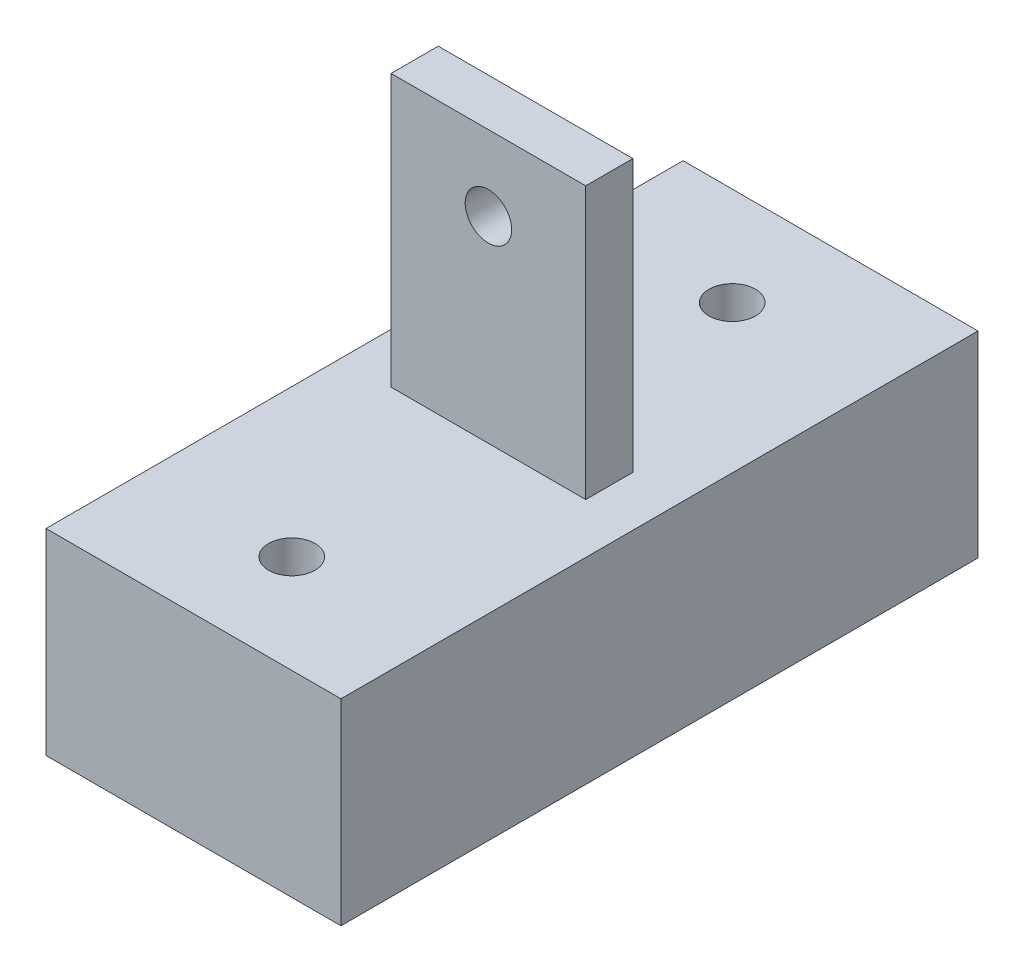
ISO-10303-21;
HEADER;
FILE_DESCRIPTION(('STEP AP214'),'2;1');
FILE_NAME('part.step','',(''),(''),'','','');
FILE_SCHEMA(('AUTOMOTIVE_DESIGN { 1 0 10303 214 1 1 1 1 }'));
ENDSEC;
DATA;
#1=APPLICATION_CONTEXT('core data for automotive mechanical design processes');
#2=APPLICATION_PROTOCOL_DEFINITION('international standard','automotive_design',2000,#1);
#3=PRODUCT_CONTEXT('',#1,'mechanical');
#4=PRODUCT('Part','Part','',(#3));
#5=PRODUCT_RELATED_PRODUCT_CATEGORY('part','',(#4));
#6=PRODUCT_DEFINITION_FORMATION('','',#4);
#7=PRODUCT_DEFINITION_CONTEXT('part definition',#1,'design');
#8=PRODUCT_DEFINITION('design','',#6,#7);
#9=PRODUCT_DEFINITION_SHAPE('','',#8);
#10=(LENGTH_UNIT() NAMED_UNIT(*) SI_UNIT(.MILLI.,.METRE.));
#11=(NAMED_UNIT(*) PLANE_ANGLE_UNIT() SI_UNIT($,.RADIAN.));
#12=(NAMED_UNIT(*) SI_UNIT($,.STERADIAN.) SOLID_ANGLE_UNIT());
#13=UNCERTAINTY_MEASURE_WITH_UNIT(LENGTH_MEASURE(1.E-05),#10,'distance_accuracy_value','');
#14=(GEOMETRIC_REPRESENTATION_CONTEXT(3) GLOBAL_UNCERTAINTY_ASSIGNED_CONTEXT((#13)) GLOBAL_UNIT_ASSIGNED_CONTEXT((#10,
#11,#12)) REPRESENTATION_CONTEXT('',''));
#15=CARTESIAN_POINT('',(0.,0.,0.));
#16=DIRECTION('',(0.,0.,1.));
#17=DIRECTION('',(1.,0.,0.));
#18=AXIS2_PLACEMENT_3D('',#15,#16,#17);
#19=CARTESIAN_POINT('',(0.,0.,-14.224));
#20=DIRECTION('',(0.,1.,0.));
#21=DIRECTION('',(0.,0.,1.));
#22=AXIS2_PLACEMENT_3D('',#19,#20,#21);
#23=CYLINDRICAL_SURFACE('',#22,1.5);
#24=CARTESIAN_POINT('',(0.,12.7,-14.224));
#25=DIRECTION('',(0.,1.,0.));
#26=DIRECTION('',(0.,0.,1.));
#27=AXIS2_PLACEMENT_3D('',#24,#25,#26);
#28=CIRCLE('',#27,1.5);
#29=CARTESIAN_POINT('',(0.,12.7,-12.724));
#30=VERTEX_POINT('',#29);
#31=EDGE_CURVE('E193',#30,#30,#28,.T.);
#32=ORIENTED_EDGE('',*,*,#31,.T.);
#33=EDGE_LOOP('',(#32));
#34=FACE_BOUND('',#33,.T.);
#35=CARTESIAN_POINT('',(0.,6.35,-14.224));
#36=DIRECTION('',(0.,-1.,0.));
#37=DIRECTION('',(0.,0.,-1.));
#38=AXIS2_PLACEMENT_3D('',#35,#36,#37);
#39=CIRCLE('',#38,1.5);
#40=CARTESIAN_POINT('',(0.,6.35,-15.724));
#41=VERTEX_POINT('',#40);
#42=EDGE_CURVE('E44',#41,#41,#39,.F.);
#43=ORIENTED_EDGE('',*,*,#42,.F.);
#44=EDGE_LOOP('',(#43));
#45=FACE_BOUND('',#44,.T.);
#46=ADVANCED_FACE('F40',(#34,#45),#23,.F.);
#47=CARTESIAN_POINT('',(0.,0.,14.224));
#48=DIRECTION('',(0.,1.,0.));
#49=DIRECTION('',(0.,0.,1.));
#50=AXIS2_PLACEMENT_3D('',#47,#48,#49);
#51=CYLINDRICAL_SURFACE('',#50,1.5);
#52=CARTESIAN_POINT('',(0.,12.7,14.224));
#53=DIRECTION('',(0.,1.,0.));
#54=DIRECTION('',(0.,0.,1.));
#55=AXIS2_PLACEMENT_3D('',#52,#53,#54);
#56=CIRCLE('',#55,1.5);
#57=CARTESIAN_POINT('',(0.,12.7,15.724));
#58=VERTEX_POINT('',#57);
#59=EDGE_CURVE('E125',#58,#58,#56,.T.);
#60=ORIENTED_EDGE('',*,*,#59,.T.);
#61=EDGE_LOOP('',(#60));
#62=FACE_BOUND('',#61,.T.);
#63=CARTESIAN_POINT('',(0.,6.35,14.224));
#64=DIRECTION('',(0.,-1.,0.));
#65=DIRECTION('',(0.,0.,-1.));
#66=AXIS2_PLACEMENT_3D('',#63,#64,#65);
#67=CIRCLE('',#66,1.5);
#68=CARTESIAN_POINT('',(0.,6.35,12.724));
#69=VERTEX_POINT('',#68);
#70=EDGE_CURVE('E184',#69,#69,#67,.F.);
#71=ORIENTED_EDGE('',*,*,#70,.F.);
#72=EDGE_LOOP('',(#71));
#73=FACE_BOUND('',#72,.T.);
#74=ADVANCED_FACE('F255',(#62,#73),#51,.F.);
#75=CARTESIAN_POINT('',(9.525,0.,-20.574));
#76=DIRECTION('',(0.,0.,-1.));
#77=DIRECTION('',(0.,1.,0.));
#78=AXIS2_PLACEMENT_3D('',#75,#76,#77);
#79=PLANE('',#78);
#80=DIRECTION('',(0.,-1.,0.));
#81=VECTOR('',#80,1.);
#82=CARTESIAN_POINT('',(-9.525,0.,-20.574));
#83=LINE('',#82,#81);
#84=CARTESIAN_POINT('',(-9.525,12.7,-20.574));
#85=VERTEX_POINT('',#84);
#86=CARTESIAN_POINT('',(-9.525,0.,-20.574));
#87=VERTEX_POINT('',#86);
#88=EDGE_CURVE('E147',#85,#87,#83,.T.);
#89=ORIENTED_EDGE('',*,*,#88,.F.);
#90=DIRECTION('',(-1.,0.,0.));
#91=VECTOR('',#90,1.);
#92=CARTESIAN_POINT('',(9.525,12.7,-20.574));
#93=LINE('',#92,#91);
#94=CARTESIAN_POINT('',(9.525,12.7,-20.574));
#95=VERTEX_POINT('',#94);
#96=EDGE_CURVE('E11',#95,#85,#93,.T.);
#97=ORIENTED_EDGE('',*,*,#96,.F.);
#98=DIRECTION('',(0.,-1.,0.));
#99=VECTOR('',#98,1.);
#100=CARTESIAN_POINT('',(9.525,0.,-20.574));
#101=LINE('',#100,#99);
#102=CARTESIAN_POINT('',(9.525,0.,-20.574));
#103=VERTEX_POINT('',#102);
#104=EDGE_CURVE('E148',#95,#103,#101,.T.);
#105=ORIENTED_EDGE('',*,*,#104,.T.);
#106=DIRECTION('',(-1.,0.,0.));
#107=VECTOR('',#106,1.);
#108=CARTESIAN_POINT('',(9.525,0.,-20.574));
#109=LINE('',#108,#107);
#110=EDGE_CURVE('E163',#103,#87,#109,.T.);
#111=ORIENTED_EDGE('',*,*,#110,.T.);
#112=EDGE_LOOP('',(#89,#97,#105,#111));
#113=FACE_BOUND('',#112,.T.);
#114=ADVANCED_FACE('F42',(#113),#79,.T.);
#115=CARTESIAN_POINT('',(9.525,12.7,0.));
#116=DIRECTION('',(0.,1.,0.));
#117=DIRECTION('',(0.,0.,1.));
#118=AXIS2_PLACEMENT_3D('',#115,#116,#117);
#119=PLANE('',#118);
#120=ORIENTED_EDGE('',*,*,#59,.F.);
#121=EDGE_LOOP('',(#120));
#122=FACE_BOUND('',#121,.T.);
#123=ORIENTED_EDGE('',*,*,#31,.F.);
#124=EDGE_LOOP('',(#123));
#125=FACE_BOUND('',#124,.T.);
#126=DIRECTION('',(0.,0.,-1.));
#127=VECTOR('',#126,1.);
#128=CARTESIAN_POINT('',(6.2865,12.7,0.));
#129=LINE('',#128,#127);
#130=CARTESIAN_POINT('',(6.2865,12.7,1.524));
#131=VERTEX_POINT('',#130);
#132=CARTESIAN_POINT('',(6.2865,12.7,-1.524));
#133=VERTEX_POINT('',#132);
#134=EDGE_CURVE('E131',#131,#133,#129,.T.);
#135=ORIENTED_EDGE('',*,*,#134,.F.);
#136=DIRECTION('',(-1.,0.,0.));
#137=VECTOR('',#136,1.);
#138=CARTESIAN_POINT('',(6.2865,12.7,1.524));
#139=LINE('',#138,#137);
#140=CARTESIAN_POINT('',(-6.2865,12.7,1.524));
#141=VERTEX_POINT('',#140);
#142=EDGE_CURVE('E142',#131,#141,#139,.T.);
#143=ORIENTED_EDGE('',*,*,#142,.T.);
#144=DIRECTION('',(0.,0.,-1.));
#145=VECTOR('',#144,1.);
#146=CARTESIAN_POINT('',(-6.2865,12.7,0.));
#147=LINE('',#146,#145);
#148=CARTESIAN_POINT('',(-6.2865,12.7,-1.524));
#149=VERTEX_POINT('',#148);
#150=EDGE_CURVE('E129',#141,#149,#147,.T.);
#151=ORIENTED_EDGE('',*,*,#150,.T.);
#152=DIRECTION('',(-1.,0.,0.));
#153=VECTOR('',#152,1.);
#154=CARTESIAN_POINT('',(6.2865,12.7,-1.524));
#155=LINE('',#154,#153);
#156=EDGE_CURVE('E66',#133,#149,#155,.T.);
#157=ORIENTED_EDGE('',*,*,#156,.F.);
#158=EDGE_LOOP('',(#135,#143,#151,#157));
#159=FACE_BOUND('',#158,.T.);
#160=DIRECTION('',(0.,0.,-1.));
#161=VECTOR('',#160,1.);
#162=CARTESIAN_POINT('',(-9.525,12.7,0.));
#163=LINE('',#162,#161);
#164=CARTESIAN_POINT('',(-9.525,12.7,20.574));
#165=VERTEX_POINT('',#164);
#166=EDGE_CURVE('E167',#165,#85,#163,.T.);
#167=ORIENTED_EDGE('',*,*,#166,.F.);
#168=DIRECTION('',(-1.,0.,0.));
#169=VECTOR('',#168,1.);
#170=CARTESIAN_POINT('',(9.525,12.7,20.574));
#171=LINE('',#170,#169);
#172=CARTESIAN_POINT('',(9.525,12.7,20.574));
#173=VERTEX_POINT('',#172);
#174=EDGE_CURVE('E50',#173,#165,#171,.T.);
#175=ORIENTED_EDGE('',*,*,#174,.F.);
#176=DIRECTION('',(0.,0.,-1.));
#177=VECTOR('',#176,1.);
#178=CARTESIAN_POINT('',(9.525,12.7,0.));
#179=LINE('',#178,#177);
#180=EDGE_CURVE('E152',#173,#95,#179,.T.);
#181=ORIENTED_EDGE('',*,*,#180,.T.);
#182=ORIENTED_EDGE('',*,*,#96,.T.);
#183=EDGE_LOOP('',(#167,#175,#181,#182));
#184=FACE_BOUND('',#183,.T.);
#185=ADVANCED_FACE('F236',(#122,#125,#159,#184),#119,.T.);
#186=CARTESIAN_POINT('',(9.525,0.,20.574));
#187=DIRECTION('',(0.,0.,-1.));
#188=DIRECTION('',(0.,1.,0.));
#189=AXIS2_PLACEMENT_3D('',#186,#187,#188);
#190=PLANE('',#189);
#191=DIRECTION('',(0.,-1.,0.));
#192=VECTOR('',#191,1.);
#193=CARTESIAN_POINT('',(-9.525,0.,20.574));
#194=LINE('',#193,#192);
#195=CARTESIAN_POINT('',(-9.525,0.,20.574));
#196=VERTEX_POINT('',#195);
#197=EDGE_CURVE('E171',#165,#196,#194,.T.);
#198=ORIENTED_EDGE('',*,*,#197,.T.);
#199=DIRECTION('',(-1.,0.,0.));
#200=VECTOR('',#199,1.);
#201=CARTESIAN_POINT('',(9.525,0.,20.574));
#202=LINE('',#201,#200);
#203=CARTESIAN_POINT('',(9.525,0.,20.574));
#204=VERTEX_POINT('',#203);
#205=EDGE_CURVE('E179',#204,#196,#202,.T.);
#206=ORIENTED_EDGE('',*,*,#205,.F.);
#207=DIRECTION('',(0.,-1.,0.));
#208=VECTOR('',#207,1.);
#209=CARTESIAN_POINT('',(9.525,0.,20.574));
#210=LINE('',#209,#208);
#211=EDGE_CURVE('E157',#173,#204,#210,.T.);
#212=ORIENTED_EDGE('',*,*,#211,.F.);
#213=ORIENTED_EDGE('',*,*,#174,.T.);
#214=EDGE_LOOP('',(#198,#206,#212,#213));
#215=FACE_BOUND('',#214,.T.);
#216=ADVANCED_FACE('F297',(#215),#190,.F.);
#217=CARTESIAN_POINT('',(9.525,0.,0.));
#218=DIRECTION('',(0.,1.,0.));
#219=DIRECTION('',(0.,0.,1.));
#220=AXIS2_PLACEMENT_3D('',#217,#218,#219);
#221=PLANE('',#220);
#222=CARTESIAN_POINT('',(0.,0.,14.224));
#223=DIRECTION('',(0.,-1.,0.));
#224=DIRECTION('',(0.,0.,-1.));
#225=AXIS2_PLACEMENT_3D('',#222,#223,#224);
#226=CIRCLE('',#225,4.7625);
#227=CARTESIAN_POINT('',(0.,0.,9.4615));
#228=VERTEX_POINT('',#227);
#229=EDGE_CURVE('E195',#228,#228,#226,.T.);
#230=ORIENTED_EDGE('',*,*,#229,.F.);
#231=EDGE_LOOP('',(#230));
#232=FACE_BOUND('',#231,.T.);
#233=CARTESIAN_POINT('',(0.,0.,-14.224));
#234=DIRECTION('',(0.,-1.,0.));
#235=DIRECTION('',(0.,0.,-1.));
#236=AXIS2_PLACEMENT_3D('',#233,#234,#235);
#237=CIRCLE('',#236,4.7625);
#238=CARTESIAN_POINT('',(0.,0.,-18.9865));
#239=VERTEX_POINT('',#238);
#240=EDGE_CURVE('E207',#239,#239,#237,.T.);
#241=ORIENTED_EDGE('',*,*,#240,.F.);
#242=EDGE_LOOP('',(#241));
#243=FACE_BOUND('',#242,.T.);
#244=DIRECTION('',(0.,0.,-1.));
#245=VECTOR('',#244,1.);
#246=CARTESIAN_POINT('',(-9.525,0.,0.));
#247=LINE('',#246,#245);
#248=EDGE_CURVE('E153',#196,#87,#247,.T.);
#249=ORIENTED_EDGE('',*,*,#248,.T.);
#250=ORIENTED_EDGE('',*,*,#110,.F.);
#251=DIRECTION('',(0.,0.,-1.));
#252=VECTOR('',#251,1.);
#253=CARTESIAN_POINT('',(9.525,0.,0.));
#254=LINE('',#253,#252);
#255=EDGE_CURVE('E160',#204,#103,#254,.T.);
#256=ORIENTED_EDGE('',*,*,#255,.F.);
#257=ORIENTED_EDGE('',*,*,#205,.T.);
#258=EDGE_LOOP('',(#249,#250,#256,#257));
#259=FACE_BOUND('',#258,.T.);
#260=ADVANCED_FACE('F315',(#232,#243,#259),#221,.F.);
#261=CARTESIAN_POINT('',(9.525,0.,0.));
#262=DIRECTION('',(1.,0.,0.));
#263=DIRECTION('',(0.,0.,-1.));
#264=AXIS2_PLACEMENT_3D('',#261,#262,#263);
#265=PLANE('',#264);
#266=ORIENTED_EDGE('',*,*,#104,.F.);
#267=ORIENTED_EDGE('',*,*,#180,.F.);
#268=ORIENTED_EDGE('',*,*,#211,.T.);
#269=ORIENTED_EDGE('',*,*,#255,.T.);
#270=EDGE_LOOP('',(#266,#267,#268,#269));
#271=FACE_BOUND('',#270,.T.);
#272=ADVANCED_FACE('F250',(#271),#265,.T.);
#273=CARTESIAN_POINT('',(-9.525,0.,0.));
#274=DIRECTION('',(1.,0.,0.));
#275=DIRECTION('',(0.,0.,-1.));
#276=AXIS2_PLACEMENT_3D('',#273,#274,#275);
#277=PLANE('',#276);
#278=ORIENTED_EDGE('',*,*,#88,.T.);
#279=ORIENTED_EDGE('',*,*,#248,.F.);
#280=ORIENTED_EDGE('',*,*,#197,.F.);
#281=ORIENTED_EDGE('',*,*,#166,.T.);
#282=EDGE_LOOP('',(#278,#279,#280,#281));
#283=FACE_BOUND('',#282,.T.);
#284=ADVANCED_FACE('F242',(#283),#277,.F.);
#285=CARTESIAN_POINT('',(6.2865,0.,-1.524));
#286=DIRECTION('',(0.,0.,1.));
#287=DIRECTION('',(0.,-1.,0.));
#288=AXIS2_PLACEMENT_3D('',#285,#286,#287);
#289=PLANE('',#288);
#290=CARTESIAN_POINT('',(0.,25.4,-1.524));
#291=DIRECTION('',(0.,0.,1.));
#292=DIRECTION('',(0.,-1.,0.));
#293=AXIS2_PLACEMENT_3D('',#290,#291,#292);
#294=CIRCLE('',#293,1.5);
#295=CARTESIAN_POINT('',(0.,23.9,-1.524));
#296=VERTEX_POINT('',#295);
#297=EDGE_CURVE('E225',#296,#296,#294,.T.);
#298=ORIENTED_EDGE('',*,*,#297,.T.);
#299=EDGE_LOOP('',(#298));
#300=FACE_BOUND('',#299,.T.);
#301=DIRECTION('',(0.,1.,0.));
#302=VECTOR('',#301,1.);
#303=CARTESIAN_POINT('',(-6.2865,0.,-1.524));
#304=LINE('',#303,#302);
#305=CARTESIAN_POINT('',(-6.2865,30.25,-1.524));
#306=VERTEX_POINT('',#305);
#307=EDGE_CURVE('E132',#149,#306,#304,.T.);
#308=ORIENTED_EDGE('',*,*,#307,.T.);
#309=DIRECTION('',(1.,0.,0.));
#310=VECTOR('',#309,1.);
#311=CARTESIAN_POINT('',(6.2865,30.25,-1.524));
#312=LINE('',#311,#310);
#313=CARTESIAN_POINT('',(6.2865,30.25,-1.524));
#314=VERTEX_POINT('',#313);
#315=EDGE_CURVE('E58',#306,#314,#312,.T.);
#316=ORIENTED_EDGE('',*,*,#315,.T.);
#317=DIRECTION('',(0.,1.,0.));
#318=VECTOR('',#317,1.);
#319=CARTESIAN_POINT('',(6.2865,0.,-1.524));
#320=LINE('',#319,#318);
#321=EDGE_CURVE('E137',#133,#314,#320,.T.);
#322=ORIENTED_EDGE('',*,*,#321,.F.);
#323=ORIENTED_EDGE('',*,*,#156,.T.);
#324=EDGE_LOOP('',(#308,#316,#322,#323));
#325=FACE_BOUND('',#324,.T.);
#326=ADVANCED_FACE('F240',(#300,#325),#289,.F.);
#327=CARTESIAN_POINT('',(6.2865,0.,1.524));
#328=DIRECTION('',(0.,0.,1.));
#329=DIRECTION('',(0.,-1.,0.));
#330=AXIS2_PLACEMENT_3D('',#327,#328,#329);
#331=PLANE('',#330);
#332=DIRECTION('',(1.,0.,0.));
#333=VECTOR('',#332,1.);
#334=CARTESIAN_POINT('',(-6.2865,30.25,1.524));
#335=LINE('',#334,#333);
#336=CARTESIAN_POINT('',(-6.2865,30.25,1.524));
#337=VERTEX_POINT('',#336);
#338=CARTESIAN_POINT('',(6.2865,30.25,1.524));
#339=VERTEX_POINT('',#338);
#340=EDGE_CURVE('E108',#337,#339,#335,.T.);
#341=ORIENTED_EDGE('',*,*,#340,.F.);
#342=DIRECTION('',(0.,1.,0.));
#343=VECTOR('',#342,1.);
#344=CARTESIAN_POINT('',(-6.2865,0.,1.524));
#345=LINE('',#344,#343);
#346=EDGE_CURVE('E120',#141,#337,#345,.T.);
#347=ORIENTED_EDGE('',*,*,#346,.F.);
#348=ORIENTED_EDGE('',*,*,#142,.F.);
#349=DIRECTION('',(0.,1.,0.));
#350=VECTOR('',#349,1.);
#351=CARTESIAN_POINT('',(6.2865,0.,1.524));
#352=LINE('',#351,#350);
#353=EDGE_CURVE('E123',#131,#339,#352,.T.);
#354=ORIENTED_EDGE('',*,*,#353,.T.);
#355=EDGE_LOOP('',(#341,#347,#348,#354));
#356=FACE_BOUND('',#355,.T.);
#357=CARTESIAN_POINT('',(0.,25.4,1.524));
#358=DIRECTION('',(0.,0.,1.));
#359=DIRECTION('',(1.,0.,0.));
#360=AXIS2_PLACEMENT_3D('',#357,#358,#359);
#361=CIRCLE('',#360,1.5);
#362=CARTESIAN_POINT('',(1.5,25.4,1.524));
#363=VERTEX_POINT('',#362);
#364=EDGE_CURVE('E221',#363,#363,#361,.T.);
#365=ORIENTED_EDGE('',*,*,#364,.F.);
#366=EDGE_LOOP('',(#365));
#367=FACE_BOUND('',#366,.T.);
#368=ADVANCED_FACE('F118',(#356,#367),#331,.T.);
#369=CARTESIAN_POINT('',(6.2865,0.,0.));
#370=DIRECTION('',(1.,0.,0.));
#371=DIRECTION('',(0.,0.,-1.));
#372=AXIS2_PLACEMENT_3D('',#369,#370,#371);
#373=PLANE('',#372);
#374=DIRECTION('',(0.,0.,1.));
#375=VECTOR('',#374,1.);
#376=CARTESIAN_POINT('',(6.2865,30.25,-20.574));
#377=LINE('',#376,#375);
#378=EDGE_CURVE('E113',#314,#339,#377,.T.);
#379=ORIENTED_EDGE('',*,*,#378,.T.);
#380=ORIENTED_EDGE('',*,*,#353,.F.);
#381=ORIENTED_EDGE('',*,*,#134,.T.);
#382=ORIENTED_EDGE('',*,*,#321,.T.);
#383=EDGE_LOOP('',(#379,#380,#381,#382));
#384=FACE_BOUND('',#383,.T.);
#385=ADVANCED_FACE('F239',(#384),#373,.T.);
#386=CARTESIAN_POINT('',(-6.2865,0.,0.));
#387=DIRECTION('',(1.,0.,0.));
#388=DIRECTION('',(0.,0.,-1.));
#389=AXIS2_PLACEMENT_3D('',#386,#387,#388);
#390=PLANE('',#389);
#391=ORIENTED_EDGE('',*,*,#346,.T.);
#392=DIRECTION('',(0.,0.,1.));
#393=VECTOR('',#392,1.);
#394=CARTESIAN_POINT('',(-6.2865,30.25,-20.574));
#395=LINE('',#394,#393);
#396=EDGE_CURVE('E105',#306,#337,#395,.T.);
#397=ORIENTED_EDGE('',*,*,#396,.F.);
#398=ORIENTED_EDGE('',*,*,#307,.F.);
#399=ORIENTED_EDGE('',*,*,#150,.F.);
#400=EDGE_LOOP('',(#391,#397,#398,#399));
#401=FACE_BOUND('',#400,.T.);
#402=ADVANCED_FACE('F127',(#401),#390,.F.);
#403=CARTESIAN_POINT('',(0.,25.4,-20.574));
#404=DIRECTION('',(0.,0.,1.));
#405=DIRECTION('',(1.,0.,0.));
#406=AXIS2_PLACEMENT_3D('',#403,#404,#405);
#407=CYLINDRICAL_SURFACE('',#406,1.5);
#408=ORIENTED_EDGE('',*,*,#364,.T.);
#409=EDGE_LOOP('',(#408));
#410=FACE_BOUND('',#409,.T.);
#411=ORIENTED_EDGE('',*,*,#297,.F.);
#412=EDGE_LOOP('',(#411));
#413=FACE_BOUND('',#412,.T.);
#414=ADVANCED_FACE('F269',(#410,#413),#407,.F.);
#415=CARTESIAN_POINT('',(-6.2865,30.25,-20.574));
#416=DIRECTION('',(0.,-1.,0.));
#417=DIRECTION('',(0.,0.,-1.));
#418=AXIS2_PLACEMENT_3D('',#415,#416,#417);
#419=PLANE('',#418);
#420=ORIENTED_EDGE('',*,*,#396,.T.);
#421=ORIENTED_EDGE('',*,*,#340,.T.);
#422=ORIENTED_EDGE('',*,*,#378,.F.);
#423=ORIENTED_EDGE('',*,*,#315,.F.);
#424=EDGE_LOOP('',(#420,#421,#422,#423));
#425=FACE_BOUND('',#424,.T.);
#426=ADVANCED_FACE('F107',(#425),#419,.F.);
#427=CARTESIAN_POINT('',(0.,6.35,14.224));
#428=DIRECTION('',(0.,-1.,0.));
#429=DIRECTION('',(0.,0.,-1.));
#430=AXIS2_PLACEMENT_3D('',#427,#428,#429);
#431=PLANE('',#430);
#432=CARTESIAN_POINT('',(0.,6.35,14.224));
#433=DIRECTION('',(0.,-1.,0.));
#434=DIRECTION('',(0.,0.,-1.));
#435=AXIS2_PLACEMENT_3D('',#432,#433,#434);
#436=CIRCLE('',#435,4.7625);
#437=CARTESIAN_POINT('',(0.,6.35,9.4615));
#438=VERTEX_POINT('',#437);
#439=EDGE_CURVE('E187',#438,#438,#436,.T.);
#440=ORIENTED_EDGE('',*,*,#439,.T.);
#441=EDGE_LOOP('',(#440));
#442=FACE_BOUND('',#441,.T.);
#443=ORIENTED_EDGE('',*,*,#70,.T.);
#444=EDGE_LOOP('',(#443));
#445=FACE_BOUND('',#444,.T.);
#446=ADVANCED_FACE('F268',(#442,#445),#431,.T.);
#447=CARTESIAN_POINT('',(0.,6.35,14.224));
#448=DIRECTION('',(0.,-1.,0.));
#449=DIRECTION('',(0.,0.,-1.));
#450=AXIS2_PLACEMENT_3D('',#447,#448,#449);
#451=CYLINDRICAL_SURFACE('',#450,4.7625);
#452=ORIENTED_EDGE('',*,*,#439,.F.);
#453=EDGE_LOOP('',(#452));
#454=FACE_BOUND('',#453,.T.);
#455=ORIENTED_EDGE('',*,*,#229,.T.);
#456=EDGE_LOOP('',(#455));
#457=FACE_BOUND('',#456,.T.);
#458=ADVANCED_FACE('F326',(#454,#457),#451,.F.);
#459=CARTESIAN_POINT('',(0.,6.35,-14.224));
#460=DIRECTION('',(0.,-1.,0.));
#461=DIRECTION('',(0.,0.,-1.));
#462=AXIS2_PLACEMENT_3D('',#459,#460,#461);
#463=PLANE('',#462);
#464=CARTESIAN_POINT('',(0.,6.35,-14.224));
#465=DIRECTION('',(0.,-1.,0.));
#466=DIRECTION('',(0.,0.,-1.));
#467=AXIS2_PLACEMENT_3D('',#464,#465,#466);
#468=CIRCLE('',#467,4.7625);
#469=CARTESIAN_POINT('',(0.,6.35,-18.9865));
#470=VERTEX_POINT('',#469);
#471=EDGE_CURVE('E201',#470,#470,#468,.T.);
#472=ORIENTED_EDGE('',*,*,#471,.T.);
#473=EDGE_LOOP('',(#472));
#474=FACE_BOUND('',#473,.T.);
#475=ORIENTED_EDGE('',*,*,#42,.T.);
#476=EDGE_LOOP('',(#475));
#477=FACE_BOUND('',#476,.T.);
#478=ADVANCED_FACE('F335',(#474,#477),#463,.T.);
#479=CARTESIAN_POINT('',(0.,6.35,-14.224));
#480=DIRECTION('',(0.,-1.,0.));
#481=DIRECTION('',(0.,0.,-1.));
#482=AXIS2_PLACEMENT_3D('',#479,#480,#481);
#483=CYLINDRICAL_SURFACE('',#482,4.7625);
#484=ORIENTED_EDGE('',*,*,#471,.F.);
#485=EDGE_LOOP('',(#484));
#486=FACE_BOUND('',#485,.T.);
#487=ORIENTED_EDGE('',*,*,#240,.T.);
#488=EDGE_LOOP('',(#487));
#489=FACE_BOUND('',#488,.T.);
#490=ADVANCED_FACE('F345',(#486,#489),#483,.F.);
#491=CLOSED_SHELL('',(#46,#74,#114,#185,#216,#260,#272,#284,#326,#368,#385,#402,#414,#426,#446,
#458,#478,#490));
#492=MANIFOLD_SOLID_BREP('B2',#491);
#493=ADVANCED_BREP_SHAPE_REPRESENTATION('',(#18,#492),#14);
#494=SHAPE_DEFINITION_REPRESENTATION(#9,#493);
ENDSEC;
END-ISO-10303-21;
